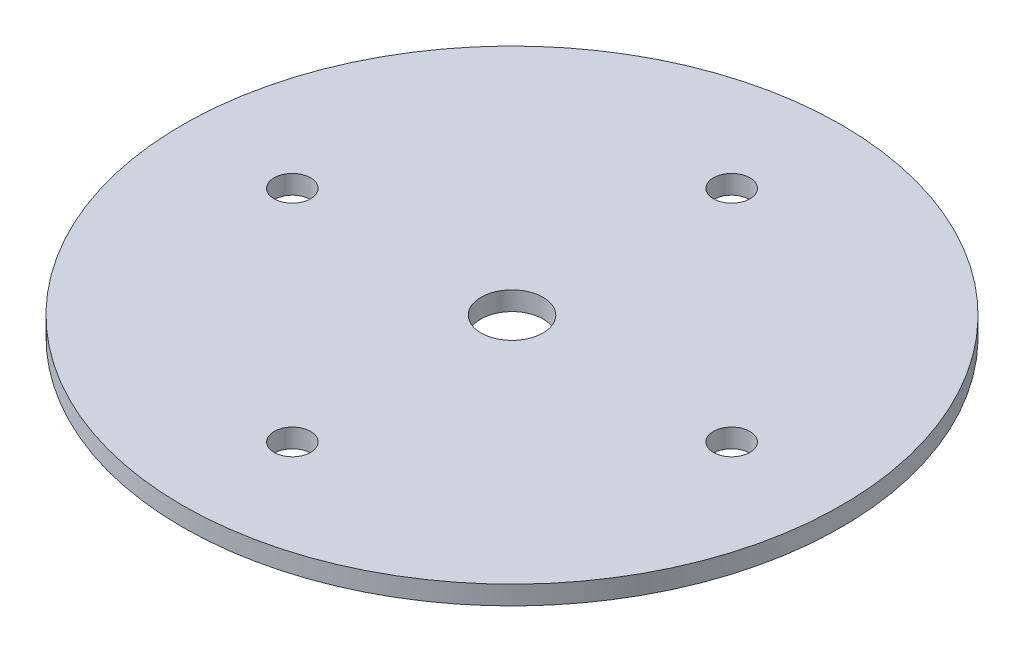
ISO-10303-21;
HEADER;
FILE_DESCRIPTION(('STEP AP214'),'2;1');
FILE_NAME('part.step','',(''),(''),'','','');
FILE_SCHEMA(('AUTOMOTIVE_DESIGN { 1 0 10303 214 1 1 1 1 }'));
ENDSEC;
DATA;
#1=APPLICATION_CONTEXT('core data for automotive mechanical design processes');
#2=APPLICATION_PROTOCOL_DEFINITION('international standard','automotive_design',2000,#1);
#3=PRODUCT_CONTEXT('',#1,'mechanical');
#4=PRODUCT('Part','Part','',(#3));
#5=PRODUCT_RELATED_PRODUCT_CATEGORY('part','',(#4));
#6=PRODUCT_DEFINITION_FORMATION('','',#4);
#7=PRODUCT_DEFINITION_CONTEXT('part definition',#1,'design');
#8=PRODUCT_DEFINITION('design','',#6,#7);
#9=PRODUCT_DEFINITION_SHAPE('','',#8);
#10=(LENGTH_UNIT() NAMED_UNIT(*) SI_UNIT(.MILLI.,.METRE.));
#11=(NAMED_UNIT(*) PLANE_ANGLE_UNIT() SI_UNIT($,.RADIAN.));
#12=(NAMED_UNIT(*) SI_UNIT($,.STERADIAN.) SOLID_ANGLE_UNIT());
#13=UNCERTAINTY_MEASURE_WITH_UNIT(LENGTH_MEASURE(1.E-05),#10,'distance_accuracy_value','');
#14=(GEOMETRIC_REPRESENTATION_CONTEXT(3) GLOBAL_UNCERTAINTY_ASSIGNED_CONTEXT((#13)) GLOBAL_UNIT_ASSIGNED_CONTEXT((#10,
#11,#12)) REPRESENTATION_CONTEXT('',''));
#15=CARTESIAN_POINT('',(0.,0.,0.));
#16=DIRECTION('',(0.,0.,1.));
#17=DIRECTION('',(1.,0.,0.));
#18=AXIS2_PLACEMENT_3D('',#15,#16,#17);
#19=CARTESIAN_POINT('',(0.,3.,0.));
#20=DIRECTION('',(0.,1.,0.));
#21=DIRECTION('',(0.,0.,1.));
#22=AXIS2_PLACEMENT_3D('',#19,#20,#21);
#23=PLANE('',#22);
#24=CARTESIAN_POINT('',(0.,3.,34.925));
#25=DIRECTION('',(0.,1.,0.));
#26=DIRECTION('',(0.,0.,1.));
#27=AXIS2_PLACEMENT_3D('',#24,#25,#26);
#28=CIRCLE('',#27,2.9);
#29=CARTESIAN_POINT('',(0.,3.,37.825));
#30=VERTEX_POINT('',#29);
#31=EDGE_CURVE('E63',#30,#30,#28,.T.);
#32=ORIENTED_EDGE('',*,*,#31,.F.);
#33=EDGE_LOOP('',(#32));
#34=FACE_BOUND('',#33,.T.);
#35=CARTESIAN_POINT('',(0.,3.,-34.925));
#36=DIRECTION('',(0.,1.,0.));
#37=DIRECTION('',(0.,0.,1.));
#38=AXIS2_PLACEMENT_3D('',#35,#36,#37);
#39=CIRCLE('',#38,2.9);
#40=CARTESIAN_POINT('',(0.,3.,-32.025));
#41=VERTEX_POINT('',#40);
#42=EDGE_CURVE('E51',#41,#41,#39,.T.);
#43=ORIENTED_EDGE('',*,*,#42,.F.);
#44=EDGE_LOOP('',(#43));
#45=FACE_BOUND('',#44,.T.);
#46=CARTESIAN_POINT('',(0.,3.,0.));
#47=DIRECTION('',(0.,1.,0.));
#48=DIRECTION('',(0.,0.,1.));
#49=AXIS2_PLACEMENT_3D('',#46,#47,#48);
#50=CIRCLE('',#49,52.4);
#51=CARTESIAN_POINT('',(0.,3.,52.4));
#52=VERTEX_POINT('',#51);
#53=EDGE_CURVE('E10',#52,#52,#50,.T.);
#54=ORIENTED_EDGE('',*,*,#53,.T.);
#55=EDGE_LOOP('',(#54));
#56=FACE_BOUND('',#55,.T.);
#57=CARTESIAN_POINT('',(0.,3.,0.));
#58=DIRECTION('',(0.,1.,0.));
#59=DIRECTION('',(0.,0.,1.));
#60=AXIS2_PLACEMENT_3D('',#57,#58,#59);
#61=CIRCLE('',#60,4.925);
#62=CARTESIAN_POINT('',(0.,3.,4.925));
#63=VERTEX_POINT('',#62);
#64=EDGE_CURVE('E46',#63,#63,#61,.T.);
#65=ORIENTED_EDGE('',*,*,#64,.F.);
#66=EDGE_LOOP('',(#65));
#67=FACE_BOUND('',#66,.T.);
#68=CARTESIAN_POINT('',(34.925,3.,0.));
#69=DIRECTION('',(0.,1.,0.));
#70=DIRECTION('',(0.,0.,1.));
#71=AXIS2_PLACEMENT_3D('',#68,#69,#70);
#72=CIRCLE('',#71,2.9);
#73=CARTESIAN_POINT('',(34.925,3.,2.9));
#74=VERTEX_POINT('',#73);
#75=EDGE_CURVE('E57',#74,#74,#72,.T.);
#76=ORIENTED_EDGE('',*,*,#75,.F.);
#77=EDGE_LOOP('',(#76));
#78=FACE_BOUND('',#77,.T.);
#79=CARTESIAN_POINT('',(-34.925,3.,0.));
#80=DIRECTION('',(0.,1.,0.));
#81=DIRECTION('',(0.,0.,1.));
#82=AXIS2_PLACEMENT_3D('',#79,#80,#81);
#83=CIRCLE('',#82,2.9);
#84=CARTESIAN_POINT('',(-34.925,3.,2.9));
#85=VERTEX_POINT('',#84);
#86=EDGE_CURVE('E69',#85,#85,#83,.T.);
#87=ORIENTED_EDGE('',*,*,#86,.F.);
#88=EDGE_LOOP('',(#87));
#89=FACE_BOUND('',#88,.T.);
#90=ADVANCED_FACE('F35',(#34,#45,#56,#67,#78,#89),#23,.T.);
#91=CARTESIAN_POINT('',(0.,0.,0.));
#92=DIRECTION('',(0.,1.,0.));
#93=DIRECTION('',(0.,0.,1.));
#94=AXIS2_PLACEMENT_3D('',#91,#92,#93);
#95=PLANE('',#94);
#96=CARTESIAN_POINT('',(0.,0.,0.));
#97=DIRECTION('',(0.,1.,0.));
#98=DIRECTION('',(0.,0.,1.));
#99=AXIS2_PLACEMENT_3D('',#96,#97,#98);
#100=CIRCLE('',#99,52.4);
#101=CARTESIAN_POINT('',(0.,0.,52.4));
#102=VERTEX_POINT('',#101);
#103=EDGE_CURVE('E39',#102,#102,#100,.T.);
#104=ORIENTED_EDGE('',*,*,#103,.F.);
#105=EDGE_LOOP('',(#104));
#106=FACE_BOUND('',#105,.T.);
#107=CARTESIAN_POINT('',(0.,0.,0.));
#108=DIRECTION('',(0.,1.,0.));
#109=DIRECTION('',(0.,0.,1.));
#110=AXIS2_PLACEMENT_3D('',#107,#108,#109);
#111=CIRCLE('',#110,4.925);
#112=CARTESIAN_POINT('',(0.,0.,4.925));
#113=VERTEX_POINT('',#112);
#114=EDGE_CURVE('E48',#113,#113,#111,.T.);
#115=ORIENTED_EDGE('',*,*,#114,.T.);
#116=EDGE_LOOP('',(#115));
#117=FACE_BOUND('',#116,.T.);
#118=CARTESIAN_POINT('',(0.,0.,-34.925));
#119=DIRECTION('',(0.,1.,0.));
#120=DIRECTION('',(0.,0.,1.));
#121=AXIS2_PLACEMENT_3D('',#118,#119,#120);
#122=CIRCLE('',#121,2.9);
#123=CARTESIAN_POINT('',(0.,0.,-32.025));
#124=VERTEX_POINT('',#123);
#125=EDGE_CURVE('E54',#124,#124,#122,.T.);
#126=ORIENTED_EDGE('',*,*,#125,.T.);
#127=EDGE_LOOP('',(#126));
#128=FACE_BOUND('',#127,.T.);
#129=CARTESIAN_POINT('',(34.925,0.,0.));
#130=DIRECTION('',(0.,1.,0.));
#131=DIRECTION('',(0.,0.,1.));
#132=AXIS2_PLACEMENT_3D('',#129,#130,#131);
#133=CIRCLE('',#132,2.9);
#134=CARTESIAN_POINT('',(34.925,0.,2.9));
#135=VERTEX_POINT('',#134);
#136=EDGE_CURVE('E60',#135,#135,#133,.T.);
#137=ORIENTED_EDGE('',*,*,#136,.T.);
#138=EDGE_LOOP('',(#137));
#139=FACE_BOUND('',#138,.T.);
#140=CARTESIAN_POINT('',(0.,0.,34.925));
#141=DIRECTION('',(0.,1.,0.));
#142=DIRECTION('',(0.,0.,1.));
#143=AXIS2_PLACEMENT_3D('',#140,#141,#142);
#144=CIRCLE('',#143,2.9);
#145=CARTESIAN_POINT('',(0.,0.,37.825));
#146=VERTEX_POINT('',#145);
#147=EDGE_CURVE('E66',#146,#146,#144,.T.);
#148=ORIENTED_EDGE('',*,*,#147,.T.);
#149=EDGE_LOOP('',(#148));
#150=FACE_BOUND('',#149,.T.);
#151=CARTESIAN_POINT('',(-34.925,0.,0.));
#152=DIRECTION('',(0.,1.,0.));
#153=DIRECTION('',(0.,0.,1.));
#154=AXIS2_PLACEMENT_3D('',#151,#152,#153);
#155=CIRCLE('',#154,2.9);
#156=CARTESIAN_POINT('',(-34.925,0.,2.9));
#157=VERTEX_POINT('',#156);
#158=EDGE_CURVE('E72',#157,#157,#155,.T.);
#159=ORIENTED_EDGE('',*,*,#158,.T.);
#160=EDGE_LOOP('',(#159));
#161=FACE_BOUND('',#160,.T.);
#162=ADVANCED_FACE('F82',(#106,#117,#128,#139,#150,#161),#95,.F.);
#163=CARTESIAN_POINT('',(0.,3.,0.));
#164=DIRECTION('',(0.,-1.,0.));
#165=DIRECTION('',(0.,0.,-1.));
#166=AXIS2_PLACEMENT_3D('',#163,#164,#165);
#167=CYLINDRICAL_SURFACE('',#166,52.4);
#168=ORIENTED_EDGE('',*,*,#53,.F.);
#169=EDGE_LOOP('',(#168));
#170=FACE_BOUND('',#169,.T.);
#171=ORIENTED_EDGE('',*,*,#103,.T.);
#172=EDGE_LOOP('',(#171));
#173=FACE_BOUND('',#172,.T.);
#174=ADVANCED_FACE('F37',(#170,#173),#167,.T.);
#175=CARTESIAN_POINT('',(0.,3.,0.));
#176=DIRECTION('',(0.,-1.,0.));
#177=DIRECTION('',(0.,0.,-1.));
#178=AXIS2_PLACEMENT_3D('',#175,#176,#177);
#179=CYLINDRICAL_SURFACE('',#178,4.925);
#180=ORIENTED_EDGE('',*,*,#64,.T.);
#181=EDGE_LOOP('',(#180));
#182=FACE_BOUND('',#181,.T.);
#183=ORIENTED_EDGE('',*,*,#114,.F.);
#184=EDGE_LOOP('',(#183));
#185=FACE_BOUND('',#184,.T.);
#186=ADVANCED_FACE('F92',(#182,#185),#179,.F.);
#187=CARTESIAN_POINT('',(0.,3.,-34.925));
#188=DIRECTION('',(0.,-1.,0.));
#189=DIRECTION('',(0.,0.,-1.));
#190=AXIS2_PLACEMENT_3D('',#187,#188,#189);
#191=CYLINDRICAL_SURFACE('',#190,2.9);
#192=ORIENTED_EDGE('',*,*,#42,.T.);
#193=EDGE_LOOP('',(#192));
#194=FACE_BOUND('',#193,.T.);
#195=ORIENTED_EDGE('',*,*,#125,.F.);
#196=EDGE_LOOP('',(#195));
#197=FACE_BOUND('',#196,.T.);
#198=ADVANCED_FACE('F95',(#194,#197),#191,.F.);
#199=CARTESIAN_POINT('',(34.925,3.,0.));
#200=DIRECTION('',(0.,-1.,0.));
#201=DIRECTION('',(0.,0.,-1.));
#202=AXIS2_PLACEMENT_3D('',#199,#200,#201);
#203=CYLINDRICAL_SURFACE('',#202,2.9);
#204=ORIENTED_EDGE('',*,*,#75,.T.);
#205=EDGE_LOOP('',(#204));
#206=FACE_BOUND('',#205,.T.);
#207=ORIENTED_EDGE('',*,*,#136,.F.);
#208=EDGE_LOOP('',(#207));
#209=FACE_BOUND('',#208,.T.);
#210=ADVANCED_FACE('F99',(#206,#209),#203,.F.);
#211=CARTESIAN_POINT('',(0.,3.,34.925));
#212=DIRECTION('',(0.,-1.,0.));
#213=DIRECTION('',(0.,0.,-1.));
#214=AXIS2_PLACEMENT_3D('',#211,#212,#213);
#215=CYLINDRICAL_SURFACE('',#214,2.9);
#216=ORIENTED_EDGE('',*,*,#31,.T.);
#217=EDGE_LOOP('',(#216));
#218=FACE_BOUND('',#217,.T.);
#219=ORIENTED_EDGE('',*,*,#147,.F.);
#220=EDGE_LOOP('',(#219));
#221=FACE_BOUND('',#220,.T.);
#222=ADVANCED_FACE('F103',(#218,#221),#215,.F.);
#223=CARTESIAN_POINT('',(-34.925,3.,0.));
#224=DIRECTION('',(0.,-1.,0.));
#225=DIRECTION('',(0.,0.,-1.));
#226=AXIS2_PLACEMENT_3D('',#223,#224,#225);
#227=CYLINDRICAL_SURFACE('',#226,2.9);
#228=ORIENTED_EDGE('',*,*,#86,.T.);
#229=EDGE_LOOP('',(#228));
#230=FACE_BOUND('',#229,.T.);
#231=ORIENTED_EDGE('',*,*,#158,.F.);
#232=EDGE_LOOP('',(#231));
#233=FACE_BOUND('',#232,.T.);
#234=ADVANCED_FACE('F78',(#230,#233),#227,.F.);
#235=CLOSED_SHELL('',(#90,#162,#174,#186,#198,#210,#222,#234));
#236=MANIFOLD_SOLID_BREP('B2',#235);
#237=ADVANCED_BREP_SHAPE_REPRESENTATION('',(#18,#236),#14);
#238=SHAPE_DEFINITION_REPRESENTATION(#9,#237);
ENDSEC;
END-ISO-10303-21;
